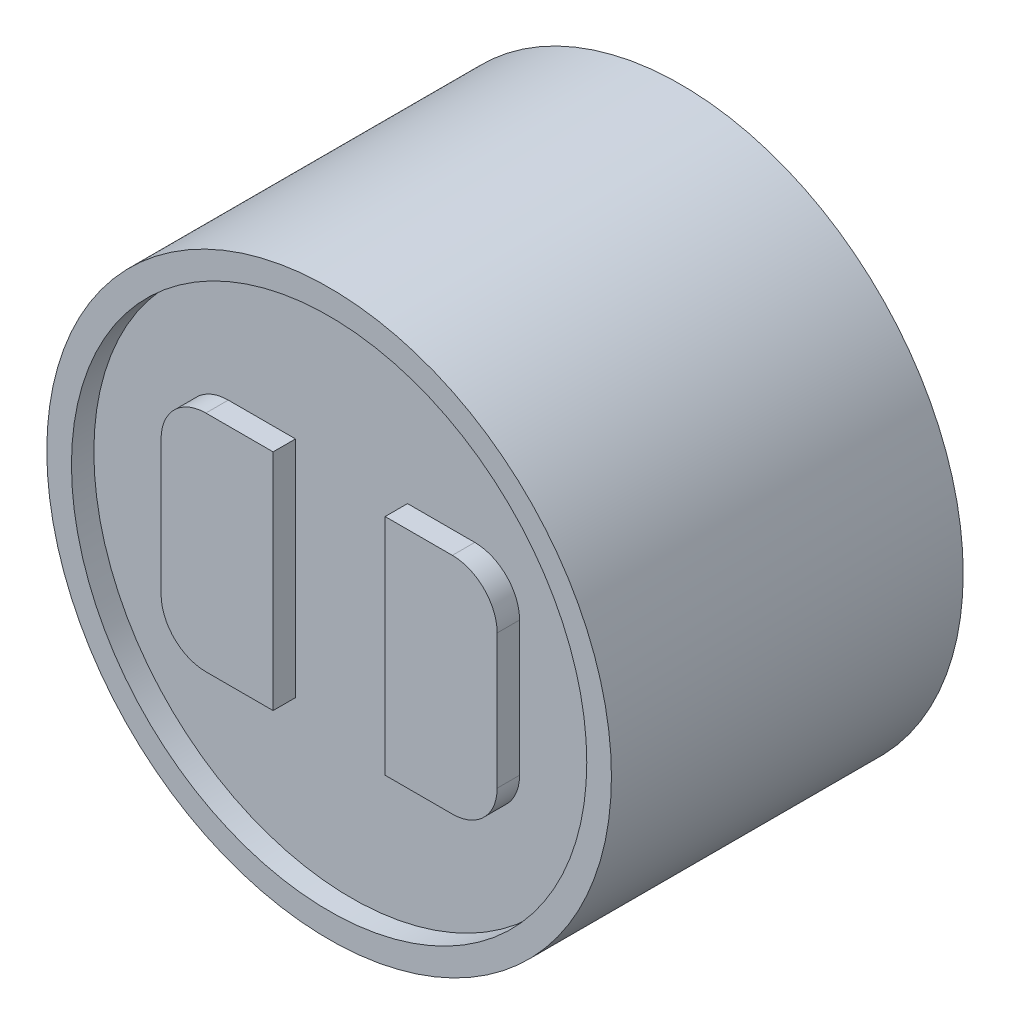
ISO-10303-21;
HEADER;
FILE_DESCRIPTION(('STEP AP214'),'2;1');
FILE_NAME('part.step','',(''),(''),'','','');
FILE_SCHEMA(('AUTOMOTIVE_DESIGN { 1 0 10303 214 1 1 1 1 }'));
ENDSEC;
DATA;
#1=APPLICATION_CONTEXT('core data for automotive mechanical design processes');
#2=APPLICATION_PROTOCOL_DEFINITION('international standard','automotive_design',2000,#1);
#3=PRODUCT_CONTEXT('',#1,'mechanical');
#4=PRODUCT('Part','Part','',(#3));
#5=PRODUCT_RELATED_PRODUCT_CATEGORY('part','',(#4));
#6=PRODUCT_DEFINITION_FORMATION('','',#4);
#7=PRODUCT_DEFINITION_CONTEXT('part definition',#1,'design');
#8=PRODUCT_DEFINITION('design','',#6,#7);
#9=PRODUCT_DEFINITION_SHAPE('','',#8);
#10=(LENGTH_UNIT() NAMED_UNIT(*) SI_UNIT(.MILLI.,.METRE.));
#11=(NAMED_UNIT(*) PLANE_ANGLE_UNIT() SI_UNIT($,.RADIAN.));
#12=(NAMED_UNIT(*) SI_UNIT($,.STERADIAN.) SOLID_ANGLE_UNIT());
#13=UNCERTAINTY_MEASURE_WITH_UNIT(LENGTH_MEASURE(1.E-05),#10,'distance_accuracy_value','');
#14=(GEOMETRIC_REPRESENTATION_CONTEXT(3) GLOBAL_UNCERTAINTY_ASSIGNED_CONTEXT((#13)) GLOBAL_UNIT_ASSIGNED_CONTEXT((#10,
#11,#12)) REPRESENTATION_CONTEXT('',''));
#15=CARTESIAN_POINT('',(0.,0.,0.));
#16=DIRECTION('',(0.,0.,1.));
#17=DIRECTION('',(1.,0.,0.));
#18=AXIS2_PLACEMENT_3D('',#15,#16,#17);
#19=CARTESIAN_POINT('',(-3.2333237010954,-8.71020362159421,28.1888965279297));
#20=DIRECTION('',(0.,0.,-1.));
#21=DIRECTION('',(-1.,0.,0.));
#22=AXIS2_PLACEMENT_3D('',#19,#20,#21);
#23=PLANE('',#22);
#24=CARTESIAN_POINT('',(-3.23332370109542,-7.18620362159421,28.1888965279297));
#25=DIRECTION('',(0.,0.,-1.));
#26=DIRECTION('',(-1.,0.,0.));
#27=AXIS2_PLACEMENT_3D('',#24,#25,#26);
#28=CIRCLE('',#27,0.508);
#29=CARTESIAN_POINT('',(-3.74132370109542,-7.18620362159421,28.1888965279297));
#30=VERTEX_POINT('',#29);
#31=CARTESIAN_POINT('',(-3.23332370109542,-6.67820362159421,28.1888965279297));
#32=VERTEX_POINT('',#31);
#33=EDGE_CURVE('E116',#30,#32,#28,.T.);
#34=ORIENTED_EDGE('',*,*,#33,.F.);
#35=DIRECTION('',(0.,1.,0.));
#36=VECTOR('',#35,1.);
#37=CARTESIAN_POINT('',(-3.74132370109541,-8.71020362159421,28.1888965279297));
#38=LINE('',#37,#36);
#39=CARTESIAN_POINT('',(-3.74132370109541,-8.71020362159421,28.1888965279297));
#40=VERTEX_POINT('',#39);
#41=EDGE_CURVE('E103',#40,#30,#38,.T.);
#42=ORIENTED_EDGE('',*,*,#41,.F.);
#43=CARTESIAN_POINT('',(-3.2333237010954,-8.71020362159421,28.1888965279297));
#44=DIRECTION('',(0.,0.,-1.));
#45=DIRECTION('',(-1.,0.,0.));
#46=AXIS2_PLACEMENT_3D('',#43,#44,#45);
#47=CIRCLE('',#46,0.508);
#48=CARTESIAN_POINT('',(-3.2333237010954,-9.21820362159421,28.1888965279297));
#49=VERTEX_POINT('',#48);
#50=EDGE_CURVE('E20',#49,#40,#47,.T.);
#51=ORIENTED_EDGE('',*,*,#50,.F.);
#52=DIRECTION('',(-1.,0.,0.));
#53=VECTOR('',#52,1.);
#54=CARTESIAN_POINT('',(-3.2333237010954,-9.21820362159421,28.1888965279297));
#55=LINE('',#54,#53);
#56=CARTESIAN_POINT('',(-2.4713237010954,-9.2182036215942,28.1888965279297));
#57=VERTEX_POINT('',#56);
#58=EDGE_CURVE('E89',#57,#49,#55,.T.);
#59=ORIENTED_EDGE('',*,*,#58,.F.);
#60=DIRECTION('',(0.,1.,0.));
#61=VECTOR('',#60,1.);
#62=CARTESIAN_POINT('',(-2.4713237010954,-9.2182036215942,28.1888965279297));
#63=LINE('',#62,#61);
#64=CARTESIAN_POINT('',(-2.47132370109542,-6.6782036215942,28.1888965279297));
#65=VERTEX_POINT('',#64);
#66=EDGE_CURVE('E197',#57,#65,#63,.T.);
#67=ORIENTED_EDGE('',*,*,#66,.T.);
#68=DIRECTION('',(-1.,0.,0.));
#69=VECTOR('',#68,1.);
#70=CARTESIAN_POINT('',(-3.23332370109542,-6.67820362159421,28.1888965279297));
#71=LINE('',#70,#69);
#72=EDGE_CURVE('E177',#65,#32,#71,.T.);
#73=ORIENTED_EDGE('',*,*,#72,.T.);
#74=EDGE_LOOP('',(#34,#42,#51,#59,#67,#73));
#75=FACE_BOUND('',#74,.T.);
#76=ADVANCED_FACE('F17',(#75),#23,.F.);
#77=CARTESIAN_POINT('',(-0.439323701095408,-8.71020362159419,28.1888965279297));
#78=DIRECTION('',(0.,0.,-1.));
#79=DIRECTION('',(-1.,0.,0.));
#80=AXIS2_PLACEMENT_3D('',#77,#78,#79);
#81=PLANE('',#80);
#82=CARTESIAN_POINT('',(-0.439323701095408,-8.71020362159419,28.1888965279297));
#83=DIRECTION('',(0.,0.,-1.));
#84=DIRECTION('',(-1.,0.,0.));
#85=AXIS2_PLACEMENT_3D('',#82,#83,#84);
#86=CIRCLE('',#85,0.508);
#87=CARTESIAN_POINT('',(0.0686762989045922,-8.71020362159418,28.1888965279297));
#88=VERTEX_POINT('',#87);
#89=CARTESIAN_POINT('',(-0.439323701095406,-9.21820362159419,28.1888965279297));
#90=VERTEX_POINT('',#89);
#91=EDGE_CURVE('E112',#88,#90,#86,.T.);
#92=ORIENTED_EDGE('',*,*,#91,.F.);
#93=DIRECTION('',(0.,1.,0.));
#94=VECTOR('',#93,1.);
#95=CARTESIAN_POINT('',(0.0686762989045922,-8.71020362159418,28.1888965279297));
#96=LINE('',#95,#94);
#97=CARTESIAN_POINT('',(0.0686762989045801,-7.18620362159418,28.1888965279297));
#98=VERTEX_POINT('',#97);
#99=EDGE_CURVE('E178',#98,#88,#96,.F.);
#100=ORIENTED_EDGE('',*,*,#99,.F.);
#101=CARTESIAN_POINT('',(-0.439323701095418,-7.18620362159419,28.1888965279297));
#102=DIRECTION('',(0.,0.,-1.));
#103=DIRECTION('',(-1.,0.,0.));
#104=AXIS2_PLACEMENT_3D('',#101,#102,#103);
#105=CIRCLE('',#104,0.508);
#106=CARTESIAN_POINT('',(-0.439323701095425,-6.67820362159419,28.1888965279297));
#107=VERTEX_POINT('',#106);
#108=EDGE_CURVE('E125',#107,#98,#105,.T.);
#109=ORIENTED_EDGE('',*,*,#108,.F.);
#110=DIRECTION('',(-1.,0.,0.));
#111=VECTOR('',#110,1.);
#112=CARTESIAN_POINT('',(-0.439323701095422,-6.67820362159419,28.1888965279297));
#113=LINE('',#112,#111);
#114=CARTESIAN_POINT('',(-1.20132370109542,-6.67820362159419,28.1888965279297));
#115=VERTEX_POINT('',#114);
#116=EDGE_CURVE('E119',#115,#107,#113,.F.);
#117=ORIENTED_EDGE('',*,*,#116,.F.);
#118=DIRECTION('',(0.,-1.,0.));
#119=VECTOR('',#118,1.);
#120=CARTESIAN_POINT('',(-1.2013237010954,-9.21820362159419,28.1888965279297));
#121=LINE('',#120,#119);
#122=CARTESIAN_POINT('',(-1.2013237010954,-9.21820362159419,28.1888965279297));
#123=VERTEX_POINT('',#122);
#124=EDGE_CURVE('E215',#115,#123,#121,.T.);
#125=ORIENTED_EDGE('',*,*,#124,.T.);
#126=DIRECTION('',(1.,0.,0.));
#127=VECTOR('',#126,1.);
#128=CARTESIAN_POINT('',(-1.2013237010954,-9.21820362159419,28.1888965279297));
#129=LINE('',#128,#127);
#130=EDGE_CURVE('E176',#123,#90,#129,.T.);
#131=ORIENTED_EDGE('',*,*,#130,.T.);
#132=EDGE_LOOP('',(#92,#100,#109,#117,#125,#131));
#133=FACE_BOUND('',#132,.T.);
#134=ADVANCED_FACE('F322',(#133),#81,.F.);
#135=CARTESIAN_POINT('',(-3.23332370109542,-7.18620362159421,28.1888965279297));
#136=DIRECTION('',(0.,0.,-1.));
#137=DIRECTION('',(-1.,0.,0.));
#138=AXIS2_PLACEMENT_3D('',#135,#136,#137);
#139=CYLINDRICAL_SURFACE('',#138,0.508);
#140=ORIENTED_EDGE('',*,*,#33,.T.);
#141=DIRECTION('',(0.,0.,-1.));
#142=VECTOR('',#141,1.);
#143=CARTESIAN_POINT('',(-3.23332370109542,-6.67820362159421,28.1888965279297));
#144=LINE('',#143,#142);
#145=CARTESIAN_POINT('',(-3.23332370109542,-6.67820362159421,27.9348965279297));
#146=VERTEX_POINT('',#145);
#147=EDGE_CURVE('E202',#32,#146,#144,.T.);
#148=ORIENTED_EDGE('',*,*,#147,.T.);
#149=CARTESIAN_POINT('',(-3.23332370109542,-7.18620362159421,27.9348965279297));
#150=DIRECTION('',(0.,0.,-1.));
#151=DIRECTION('',(-1.,0.,0.));
#152=AXIS2_PLACEMENT_3D('',#149,#150,#151);
#153=CIRCLE('',#152,0.508);
#154=CARTESIAN_POINT('',(-3.74132370109542,-7.18620362159421,27.9348965279297));
#155=VERTEX_POINT('',#154);
#156=EDGE_CURVE('E168',#155,#146,#153,.T.);
#157=ORIENTED_EDGE('',*,*,#156,.F.);
#158=DIRECTION('',(0.,0.,-1.));
#159=VECTOR('',#158,1.);
#160=CARTESIAN_POINT('',(-3.74132370109542,-7.18620362159421,28.1888965279297));
#161=LINE('',#160,#159);
#162=EDGE_CURVE('E113',#155,#30,#161,.F.);
#163=ORIENTED_EDGE('',*,*,#162,.T.);
#164=EDGE_LOOP('',(#140,#148,#157,#163));
#165=FACE_BOUND('',#164,.T.);
#166=ADVANCED_FACE('F494',(#165),#139,.T.);
#167=CARTESIAN_POINT('',(-3.23332370109542,-6.67820362159421,28.1888965279297));
#168=DIRECTION('',(0.,-1.,0.));
#169=DIRECTION('',(-1.,0.,0.));
#170=AXIS2_PLACEMENT_3D('',#167,#168,#169);
#171=PLANE('',#170);
#172=ORIENTED_EDGE('',*,*,#147,.F.);
#173=ORIENTED_EDGE('',*,*,#72,.F.);
#174=DIRECTION('',(0.,0.,-1.));
#175=VECTOR('',#174,1.);
#176=CARTESIAN_POINT('',(-2.47132370109542,-6.6782036215942,28.1888965279297));
#177=LINE('',#176,#175);
#178=CARTESIAN_POINT('',(-2.47132370109542,-6.6782036215942,27.9348965279297));
#179=VERTEX_POINT('',#178);
#180=EDGE_CURVE('E201',#65,#179,#177,.T.);
#181=ORIENTED_EDGE('',*,*,#180,.T.);
#182=DIRECTION('',(1.,0.,0.));
#183=VECTOR('',#182,1.);
#184=CARTESIAN_POINT('',(-1.83632370109542,-6.6782036215942,27.9348965279297));
#185=LINE('',#184,#183);
#186=EDGE_CURVE('E172',#146,#179,#185,.T.);
#187=ORIENTED_EDGE('',*,*,#186,.F.);
#188=EDGE_LOOP('',(#172,#173,#181,#187));
#189=FACE_BOUND('',#188,.T.);
#190=ADVANCED_FACE('F254',(#189),#171,.F.);
#191=CARTESIAN_POINT('',(-2.4713237010954,-9.2182036215942,28.1888965279297));
#192=DIRECTION('',(-1.,0.,0.));
#193=DIRECTION('',(0.,1.,0.));
#194=AXIS2_PLACEMENT_3D('',#191,#192,#193);
#195=PLANE('',#194);
#196=ORIENTED_EDGE('',*,*,#180,.F.);
#197=ORIENTED_EDGE('',*,*,#66,.F.);
#198=DIRECTION('',(0.,0.,-1.));
#199=VECTOR('',#198,1.);
#200=CARTESIAN_POINT('',(-2.4713237010954,-9.2182036215942,28.1888965279297));
#201=LINE('',#200,#199);
#202=CARTESIAN_POINT('',(-2.4713237010954,-9.2182036215942,27.9348965279297));
#203=VERTEX_POINT('',#202);
#204=EDGE_CURVE('E238',#57,#203,#201,.T.);
#205=ORIENTED_EDGE('',*,*,#204,.T.);
#206=DIRECTION('',(0.,1.,0.));
#207=VECTOR('',#206,1.);
#208=CARTESIAN_POINT('',(-2.47132370109541,-7.9482036215942,27.9348965279297));
#209=LINE('',#208,#207);
#210=EDGE_CURVE('E243',#179,#203,#209,.F.);
#211=ORIENTED_EDGE('',*,*,#210,.F.);
#212=EDGE_LOOP('',(#196,#197,#205,#211));
#213=FACE_BOUND('',#212,.T.);
#214=ADVANCED_FACE('F259',(#213),#195,.F.);
#215=CARTESIAN_POINT('',(-3.2333237010954,-9.21820362159421,28.1888965279297));
#216=DIRECTION('',(0.,1.,0.));
#217=DIRECTION('',(1.,0.,0.));
#218=AXIS2_PLACEMENT_3D('',#215,#216,#217);
#219=PLANE('',#218);
#220=ORIENTED_EDGE('',*,*,#204,.F.);
#221=ORIENTED_EDGE('',*,*,#58,.T.);
#222=DIRECTION('',(0.,0.,-1.));
#223=VECTOR('',#222,1.);
#224=CARTESIAN_POINT('',(-3.2333237010954,-9.21820362159421,28.1888965279297));
#225=LINE('',#224,#223);
#226=CARTESIAN_POINT('',(-3.2333237010954,-9.21820362159421,27.9348965279297));
#227=VERTEX_POINT('',#226);
#228=EDGE_CURVE('E99',#227,#49,#225,.F.);
#229=ORIENTED_EDGE('',*,*,#228,.F.);
#230=DIRECTION('',(1.,0.,0.));
#231=VECTOR('',#230,1.);
#232=CARTESIAN_POINT('',(-1.8363237010954,-9.2182036215942,27.9348965279297));
#233=LINE('',#232,#231);
#234=EDGE_CURVE('E167',#203,#227,#233,.F.);
#235=ORIENTED_EDGE('',*,*,#234,.F.);
#236=EDGE_LOOP('',(#220,#221,#229,#235));
#237=FACE_BOUND('',#236,.T.);
#238=ADVANCED_FACE('F316',(#237),#219,.F.);
#239=CARTESIAN_POINT('',(-3.2333237010954,-8.71020362159421,28.1888965279297));
#240=DIRECTION('',(0.,0.,-1.));
#241=DIRECTION('',(-1.,0.,0.));
#242=AXIS2_PLACEMENT_3D('',#239,#240,#241);
#243=CYLINDRICAL_SURFACE('',#242,0.508);
#244=ORIENTED_EDGE('',*,*,#50,.T.);
#245=DIRECTION('',(0.,0.,-1.));
#246=VECTOR('',#245,1.);
#247=CARTESIAN_POINT('',(-3.74132370109541,-8.71020362159421,28.1888965279297));
#248=LINE('',#247,#246);
#249=CARTESIAN_POINT('',(-3.74132370109541,-8.71020362159421,27.9348965279297));
#250=VERTEX_POINT('',#249);
#251=EDGE_CURVE('E97',#40,#250,#248,.T.);
#252=ORIENTED_EDGE('',*,*,#251,.T.);
#253=CARTESIAN_POINT('',(-3.2333237010954,-8.71020362159421,27.9348965279297));
#254=DIRECTION('',(0.,0.,-1.));
#255=DIRECTION('',(-1.,0.,0.));
#256=AXIS2_PLACEMENT_3D('',#253,#254,#255);
#257=CIRCLE('',#256,0.508);
#258=EDGE_CURVE('E164',#227,#250,#257,.T.);
#259=ORIENTED_EDGE('',*,*,#258,.F.);
#260=ORIENTED_EDGE('',*,*,#228,.T.);
#261=EDGE_LOOP('',(#244,#252,#259,#260));
#262=FACE_BOUND('',#261,.T.);
#263=ADVANCED_FACE('F95',(#262),#243,.T.);
#264=CARTESIAN_POINT('',(-3.74132370109541,-8.71020362159421,28.1888965279297));
#265=DIRECTION('',(1.,0.,0.));
#266=DIRECTION('',(0.,-1.,0.));
#267=AXIS2_PLACEMENT_3D('',#264,#265,#266);
#268=PLANE('',#267);
#269=ORIENTED_EDGE('',*,*,#251,.F.);
#270=ORIENTED_EDGE('',*,*,#41,.T.);
#271=ORIENTED_EDGE('',*,*,#162,.F.);
#272=DIRECTION('',(0.,1.,0.));
#273=VECTOR('',#272,1.);
#274=CARTESIAN_POINT('',(-3.74132370109542,-7.94820362159421,27.9348965279297));
#275=LINE('',#274,#273);
#276=EDGE_CURVE('E109',#250,#155,#275,.T.);
#277=ORIENTED_EDGE('',*,*,#276,.F.);
#278=EDGE_LOOP('',(#269,#270,#271,#277));
#279=FACE_BOUND('',#278,.T.);
#280=ADVANCED_FACE('F105',(#279),#268,.F.);
#281=CARTESIAN_POINT('',(-0.439323701095408,-8.71020362159419,28.1888965279297));
#282=DIRECTION('',(0.,0.,-1.));
#283=DIRECTION('',(-1.,0.,0.));
#284=AXIS2_PLACEMENT_3D('',#281,#282,#283);
#285=CYLINDRICAL_SURFACE('',#284,0.508);
#286=ORIENTED_EDGE('',*,*,#91,.T.);
#287=DIRECTION('',(0.,0.,-1.));
#288=VECTOR('',#287,1.);
#289=CARTESIAN_POINT('',(-0.439323701095408,-9.21820362159419,28.1888965279297));
#290=LINE('',#289,#288);
#291=CARTESIAN_POINT('',(-0.439323701095406,-9.21820362159419,27.9348965279297));
#292=VERTEX_POINT('',#291);
#293=EDGE_CURVE('E220',#90,#292,#290,.T.);
#294=ORIENTED_EDGE('',*,*,#293,.T.);
#295=CARTESIAN_POINT('',(-0.439323701095408,-8.71020362159419,27.9348965279297));
#296=DIRECTION('',(0.,0.,-1.));
#297=DIRECTION('',(-1.,0.,0.));
#298=AXIS2_PLACEMENT_3D('',#295,#296,#297);
#299=CIRCLE('',#298,0.508);
#300=CARTESIAN_POINT('',(0.0686762989045922,-8.71020362159418,27.9348965279297));
#301=VERTEX_POINT('',#300);
#302=EDGE_CURVE('E159',#301,#292,#299,.T.);
#303=ORIENTED_EDGE('',*,*,#302,.F.);
#304=DIRECTION('',(0.,0.,-1.));
#305=VECTOR('',#304,1.);
#306=CARTESIAN_POINT('',(0.0686762989045922,-8.71020362159418,28.1888965279297));
#307=LINE('',#306,#305);
#308=EDGE_CURVE('E273',#301,#88,#307,.F.);
#309=ORIENTED_EDGE('',*,*,#308,.T.);
#310=EDGE_LOOP('',(#286,#294,#303,#309));
#311=FACE_BOUND('',#310,.T.);
#312=ADVANCED_FACE('F330',(#311),#285,.T.);
#313=CARTESIAN_POINT('',(-1.2013237010954,-9.21820362159419,28.1888965279297));
#314=DIRECTION('',(0.,1.,0.));
#315=DIRECTION('',(1.,0.,0.));
#316=AXIS2_PLACEMENT_3D('',#313,#314,#315);
#317=PLANE('',#316);
#318=ORIENTED_EDGE('',*,*,#293,.F.);
#319=ORIENTED_EDGE('',*,*,#130,.F.);
#320=DIRECTION('',(0.,0.,-1.));
#321=VECTOR('',#320,1.);
#322=CARTESIAN_POINT('',(-1.2013237010954,-9.21820362159419,28.1888965279297));
#323=LINE('',#322,#321);
#324=CARTESIAN_POINT('',(-1.2013237010954,-9.21820362159419,27.9348965279297));
#325=VERTEX_POINT('',#324);
#326=EDGE_CURVE('E219',#123,#325,#323,.T.);
#327=ORIENTED_EDGE('',*,*,#326,.T.);
#328=DIRECTION('',(1.,0.,0.));
#329=VECTOR('',#328,1.);
#330=CARTESIAN_POINT('',(-1.8363237010954,-9.2182036215942,27.9348965279297));
#331=LINE('',#330,#329);
#332=EDGE_CURVE('E163',#292,#325,#331,.F.);
#333=ORIENTED_EDGE('',*,*,#332,.F.);
#334=EDGE_LOOP('',(#318,#319,#327,#333));
#335=FACE_BOUND('',#334,.T.);
#336=ADVANCED_FACE('F295',(#335),#317,.F.);
#337=CARTESIAN_POINT('',(-1.2013237010954,-9.21820362159419,28.1888965279297));
#338=DIRECTION('',(1.,0.,0.));
#339=DIRECTION('',(0.,-1.,0.));
#340=AXIS2_PLACEMENT_3D('',#337,#338,#339);
#341=PLANE('',#340);
#342=ORIENTED_EDGE('',*,*,#326,.F.);
#343=ORIENTED_EDGE('',*,*,#124,.F.);
#344=DIRECTION('',(0.,0.,-1.));
#345=VECTOR('',#344,1.);
#346=CARTESIAN_POINT('',(-1.20132370109542,-6.67820362159419,28.1888965279297));
#347=LINE('',#346,#345);
#348=CARTESIAN_POINT('',(-1.20132370109542,-6.67820362159419,27.9348965279297));
#349=VERTEX_POINT('',#348);
#350=EDGE_CURVE('E280',#115,#349,#347,.T.);
#351=ORIENTED_EDGE('',*,*,#350,.T.);
#352=DIRECTION('',(0.,1.,0.));
#353=VECTOR('',#352,1.);
#354=CARTESIAN_POINT('',(-1.20132370109541,-7.94820362159419,27.9348965279297));
#355=LINE('',#354,#353);
#356=EDGE_CURVE('E285',#325,#349,#355,.T.);
#357=ORIENTED_EDGE('',*,*,#356,.F.);
#358=EDGE_LOOP('',(#342,#343,#351,#357));
#359=FACE_BOUND('',#358,.T.);
#360=ADVANCED_FACE('F300',(#359),#341,.F.);
#361=CARTESIAN_POINT('',(-1.20132370109542,-6.67820362159419,28.1888965279297));
#362=DIRECTION('',(0.,-1.,0.));
#363=DIRECTION('',(-1.,0.,0.));
#364=AXIS2_PLACEMENT_3D('',#361,#362,#363);
#365=PLANE('',#364);
#366=ORIENTED_EDGE('',*,*,#350,.F.);
#367=ORIENTED_EDGE('',*,*,#116,.T.);
#368=DIRECTION('',(0.,0.,-1.));
#369=VECTOR('',#368,1.);
#370=CARTESIAN_POINT('',(-0.439323701095427,-6.67820362159419,28.1888965279297));
#371=LINE('',#370,#369);
#372=CARTESIAN_POINT('',(-0.439323701095425,-6.67820362159419,27.9348965279297));
#373=VERTEX_POINT('',#372);
#374=EDGE_CURVE('E277',#373,#107,#371,.F.);
#375=ORIENTED_EDGE('',*,*,#374,.F.);
#376=DIRECTION('',(1.,0.,0.));
#377=VECTOR('',#376,1.);
#378=CARTESIAN_POINT('',(-1.83632370109542,-6.6782036215942,27.9348965279297));
#379=LINE('',#378,#377);
#380=EDGE_CURVE('E158',#349,#373,#379,.T.);
#381=ORIENTED_EDGE('',*,*,#380,.F.);
#382=EDGE_LOOP('',(#366,#367,#375,#381));
#383=FACE_BOUND('',#382,.T.);
#384=ADVANCED_FACE('F324',(#383),#365,.F.);
#385=CARTESIAN_POINT('',(-0.439323701095418,-7.18620362159419,28.1888965279297));
#386=DIRECTION('',(0.,0.,-1.));
#387=DIRECTION('',(-1.,0.,0.));
#388=AXIS2_PLACEMENT_3D('',#385,#386,#387);
#389=CYLINDRICAL_SURFACE('',#388,0.508);
#390=ORIENTED_EDGE('',*,*,#108,.T.);
#391=DIRECTION('',(0.,0.,-1.));
#392=VECTOR('',#391,1.);
#393=CARTESIAN_POINT('',(0.0686762989045801,-7.18620362159418,28.1888965279297));
#394=LINE('',#393,#392);
#395=CARTESIAN_POINT('',(0.0686762989045801,-7.18620362159418,27.9348965279297));
#396=VERTEX_POINT('',#395);
#397=EDGE_CURVE('E36',#98,#396,#394,.T.);
#398=ORIENTED_EDGE('',*,*,#397,.T.);
#399=CARTESIAN_POINT('',(-0.439323701095418,-7.18620362159419,27.9348965279297));
#400=DIRECTION('',(0.,0.,-1.));
#401=DIRECTION('',(-1.,0.,0.));
#402=AXIS2_PLACEMENT_3D('',#399,#400,#401);
#403=CIRCLE('',#402,0.508);
#404=EDGE_CURVE('E154',#373,#396,#403,.T.);
#405=ORIENTED_EDGE('',*,*,#404,.F.);
#406=ORIENTED_EDGE('',*,*,#374,.T.);
#407=EDGE_LOOP('',(#390,#398,#405,#406));
#408=FACE_BOUND('',#407,.T.);
#409=ADVANCED_FACE('F370',(#408),#389,.T.);
#410=CARTESIAN_POINT('',(0.0686762989045922,-8.71020362159418,28.1888965279297));
#411=DIRECTION('',(-1.,0.,0.));
#412=DIRECTION('',(0.,1.,0.));
#413=AXIS2_PLACEMENT_3D('',#410,#411,#412);
#414=PLANE('',#413);
#415=ORIENTED_EDGE('',*,*,#397,.F.);
#416=ORIENTED_EDGE('',*,*,#99,.T.);
#417=ORIENTED_EDGE('',*,*,#308,.F.);
#418=DIRECTION('',(0.,1.,0.));
#419=VECTOR('',#418,1.);
#420=CARTESIAN_POINT('',(0.068676298904587,-7.94820362159418,27.9348965279297));
#421=LINE('',#420,#419);
#422=EDGE_CURVE('E153',#396,#301,#421,.F.);
#423=ORIENTED_EDGE('',*,*,#422,.F.);
#424=EDGE_LOOP('',(#415,#416,#417,#423));
#425=FACE_BOUND('',#424,.T.);
#426=ADVANCED_FACE('F329',(#425),#414,.F.);
#427=CARTESIAN_POINT('',(-1.83632370109541,-7.9482036215942,24.8360965279297));
#428=DIRECTION('',(0.,0.,-1.));
#429=DIRECTION('',(-1.,0.,0.));
#430=AXIS2_PLACEMENT_3D('',#427,#428,#429);
#431=PLANE('',#430);
#432=CARTESIAN_POINT('',(-1.83632370109541,-7.9482036215942,24.8360965279297));
#433=DIRECTION('',(0.,0.,-1.));
#434=DIRECTION('',(-1.,0.,0.));
#435=AXIS2_PLACEMENT_3D('',#432,#433,#434);
#436=CIRCLE('',#435,0.635);
#437=CARTESIAN_POINT('',(-2.47132370109541,-7.94820362159421,24.8360965279297));
#438=VERTEX_POINT('',#437);
#439=EDGE_CURVE('E150',#438,#438,#436,.T.);
#440=ORIENTED_EDGE('',*,*,#439,.T.);
#441=EDGE_LOOP('',(#440));
#442=FACE_BOUND('',#441,.T.);
#443=ADVANCED_FACE('F364',(#442),#431,.T.);
#444=CARTESIAN_POINT('',(-1.83632370109541,-7.9482036215942,27.9348965279297));
#445=DIRECTION('',(0.,0.,1.));
#446=DIRECTION('',(1.,0.,0.));
#447=AXIS2_PLACEMENT_3D('',#444,#445,#446);
#448=PLANE('',#447);
#449=ORIENTED_EDGE('',*,*,#404,.T.);
#450=ORIENTED_EDGE('',*,*,#422,.T.);
#451=ORIENTED_EDGE('',*,*,#302,.T.);
#452=ORIENTED_EDGE('',*,*,#332,.T.);
#453=ORIENTED_EDGE('',*,*,#356,.T.);
#454=ORIENTED_EDGE('',*,*,#380,.T.);
#455=EDGE_LOOP('',(#449,#450,#451,#452,#453,#454));
#456=FACE_BOUND('',#455,.T.);
#457=CARTESIAN_POINT('',(-1.83632370109541,-7.9482036215942,27.9348965279297));
#458=DIRECTION('',(0.,0.,1.));
#459=DIRECTION('',(1.,0.,0.));
#460=AXIS2_PLACEMENT_3D('',#457,#458,#459);
#461=CIRCLE('',#460,2.921);
#462=CARTESIAN_POINT('',(1.08467629890459,-7.94820362159418,27.9348965279297));
#463=VERTEX_POINT('',#462);
#464=EDGE_CURVE('E146',#463,#463,#461,.T.);
#465=ORIENTED_EDGE('',*,*,#464,.T.);
#466=EDGE_LOOP('',(#465));
#467=FACE_BOUND('',#466,.T.);
#468=ORIENTED_EDGE('',*,*,#258,.T.);
#469=ORIENTED_EDGE('',*,*,#276,.T.);
#470=ORIENTED_EDGE('',*,*,#156,.T.);
#471=ORIENTED_EDGE('',*,*,#186,.T.);
#472=ORIENTED_EDGE('',*,*,#210,.T.);
#473=ORIENTED_EDGE('',*,*,#234,.T.);
#474=EDGE_LOOP('',(#468,#469,#470,#471,#472,#473));
#475=FACE_BOUND('',#474,.T.);
#476=ADVANCED_FACE('F263',(#456,#467,#475),#448,.T.);
#477=CARTESIAN_POINT('',(-1.83632370109541,-7.9482036215942,24.8360965279297));
#478=DIRECTION('',(0.,0.,-1.));
#479=DIRECTION('',(-1.,0.,0.));
#480=AXIS2_PLACEMENT_3D('',#477,#478,#479);
#481=CYLINDRICAL_SURFACE('',#480,0.635);
#482=CARTESIAN_POINT('',(-1.83632370109541,-7.9482036215942,24.2010965279297));
#483=DIRECTION('',(0.,0.,-1.));
#484=DIRECTION('',(-1.,0.,0.));
#485=AXIS2_PLACEMENT_3D('',#482,#483,#484);
#486=CIRCLE('',#485,0.635);
#487=CARTESIAN_POINT('',(-2.47132370109541,-7.94820362159421,24.2010965279297));
#488=VERTEX_POINT('',#487);
#489=EDGE_CURVE('E142',#488,#488,#486,.F.);
#490=ORIENTED_EDGE('',*,*,#489,.F.);
#491=EDGE_LOOP('',(#490));
#492=FACE_BOUND('',#491,.T.);
#493=ORIENTED_EDGE('',*,*,#439,.F.);
#494=EDGE_LOOP('',(#493));
#495=FACE_BOUND('',#494,.T.);
#496=ADVANCED_FACE('F357',(#492,#495),#481,.F.);
#497=CARTESIAN_POINT('',(-1.83632370109541,-7.9482036215942,27.9348965279297));
#498=DIRECTION('',(0.,0.,1.));
#499=DIRECTION('',(1.,0.,0.));
#500=AXIS2_PLACEMENT_3D('',#497,#498,#499);
#501=CYLINDRICAL_SURFACE('',#500,2.921);
#502=ORIENTED_EDGE('',*,*,#464,.F.);
#503=EDGE_LOOP('',(#502));
#504=FACE_BOUND('',#503,.T.);
#505=CARTESIAN_POINT('',(-1.83632370109541,-7.9482036215942,28.1888965279297));
#506=DIRECTION('',(0.,0.,1.));
#507=DIRECTION('',(1.,0.,0.));
#508=AXIS2_PLACEMENT_3D('',#505,#506,#507);
#509=CIRCLE('',#508,2.921);
#510=CARTESIAN_POINT('',(1.08467629890459,-7.94820362159418,28.1888965279297));
#511=VERTEX_POINT('',#510);
#512=EDGE_CURVE('E138',#511,#511,#509,.T.);
#513=ORIENTED_EDGE('',*,*,#512,.T.);
#514=EDGE_LOOP('',(#513));
#515=FACE_BOUND('',#514,.T.);
#516=ADVANCED_FACE('F353',(#504,#515),#501,.F.);
#517=CARTESIAN_POINT('',(-1.83632370109541,-7.9482036215942,24.2010965279297));
#518=DIRECTION('',(0.,0.,-1.));
#519=DIRECTION('',(-1.,0.,0.));
#520=AXIS2_PLACEMENT_3D('',#517,#518,#519);
#521=PLANE('',#520);
#522=CARTESIAN_POINT('',(-1.83632370109541,-7.9482036215942,24.2010965279297));
#523=DIRECTION('',(0.,0.,1.));
#524=DIRECTION('',(1.,0.,0.));
#525=AXIS2_PLACEMENT_3D('',#522,#523,#524);
#526=CIRCLE('',#525,3.2004);
#527=CARTESIAN_POINT('',(1.36407629890458,-7.94820362159418,24.2010965279297));
#528=VERTEX_POINT('',#527);
#529=EDGE_CURVE('E27',#528,#528,#526,.T.);
#530=ORIENTED_EDGE('',*,*,#529,.F.);
#531=EDGE_LOOP('',(#530));
#532=FACE_BOUND('',#531,.T.);
#533=ORIENTED_EDGE('',*,*,#489,.T.);
#534=EDGE_LOOP('',(#533));
#535=FACE_BOUND('',#534,.T.);
#536=ADVANCED_FACE('F346',(#532,#535),#521,.T.);
#537=CARTESIAN_POINT('',(-1.83632370109541,-7.9482036215942,28.1888965279297));
#538=DIRECTION('',(0.,0.,-1.));
#539=DIRECTION('',(-1.,0.,0.));
#540=AXIS2_PLACEMENT_3D('',#537,#538,#539);
#541=PLANE('',#540);
#542=CARTESIAN_POINT('',(-1.83632370109541,-7.9482036215942,28.1888965279297));
#543=DIRECTION('',(0.,0.,1.));
#544=DIRECTION('',(1.,0.,0.));
#545=AXIS2_PLACEMENT_3D('',#542,#543,#544);
#546=CIRCLE('',#545,3.2004);
#547=CARTESIAN_POINT('',(1.36407629890458,-7.94820362159418,28.1888965279297));
#548=VERTEX_POINT('',#547);
#549=EDGE_CURVE('E11',#548,#548,#546,.F.);
#550=ORIENTED_EDGE('',*,*,#549,.F.);
#551=EDGE_LOOP('',(#550));
#552=FACE_BOUND('',#551,.T.);
#553=ORIENTED_EDGE('',*,*,#512,.F.);
#554=EDGE_LOOP('',(#553));
#555=FACE_BOUND('',#554,.T.);
#556=ADVANCED_FACE('F341',(#552,#555),#541,.F.);
#557=CARTESIAN_POINT('',(-1.83632370109541,-7.9482036215942,24.2010965279297));
#558=DIRECTION('',(0.,0.,1.));
#559=DIRECTION('',(1.,0.,0.));
#560=AXIS2_PLACEMENT_3D('',#557,#558,#559);
#561=CYLINDRICAL_SURFACE('',#560,3.2004);
#562=ORIENTED_EDGE('',*,*,#549,.T.);
#563=EDGE_LOOP('',(#562));
#564=FACE_BOUND('',#563,.T.);
#565=ORIENTED_EDGE('',*,*,#529,.T.);
#566=EDGE_LOOP('',(#565));
#567=FACE_BOUND('',#566,.T.);
#568=ADVANCED_FACE('F339',(#564,#567),#561,.T.);
#569=CLOSED_SHELL('',(#76,#134,#166,#190,#214,#238,#263,#280,#312,#336,#360,#384,#409,#426,#443,
#476,#496,#516,#536,#556,#568));
#570=MANIFOLD_SOLID_BREP('B1',#569);
#571=ADVANCED_BREP_SHAPE_REPRESENTATION('',(#18,#570),#14);
#572=SHAPE_DEFINITION_REPRESENTATION(#9,#571);
ENDSEC;
END-ISO-10303-21;
